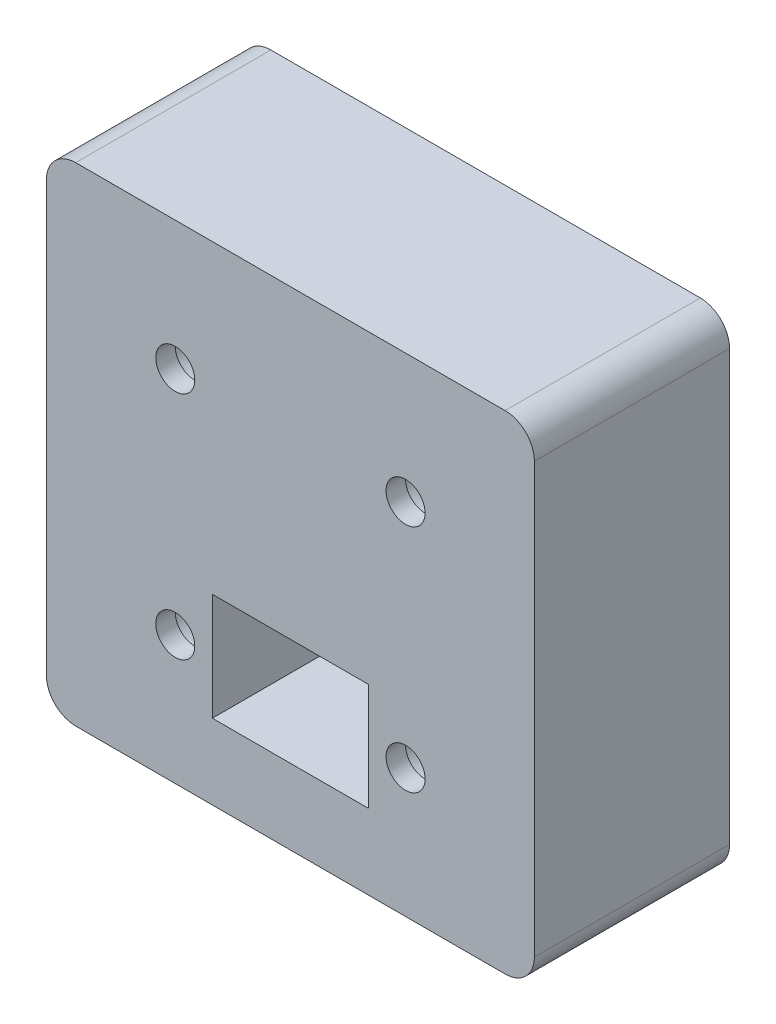
ISO-10303-21;
HEADER;
FILE_DESCRIPTION(('STEP AP214'),'2;1');
FILE_NAME('part.step','',(''),(''),'','','');
FILE_SCHEMA(('AUTOMOTIVE_DESIGN { 1 0 10303 214 1 1 1 1 }'));
ENDSEC;
DATA;
#1=APPLICATION_CONTEXT('core data for automotive mechanical design processes');
#2=APPLICATION_PROTOCOL_DEFINITION('international standard','automotive_design',2000,#1);
#3=PRODUCT_CONTEXT('',#1,'mechanical');
#4=PRODUCT('Part','Part','',(#3));
#5=PRODUCT_RELATED_PRODUCT_CATEGORY('part','',(#4));
#6=PRODUCT_DEFINITION_FORMATION('','',#4);
#7=PRODUCT_DEFINITION_CONTEXT('part definition',#1,'design');
#8=PRODUCT_DEFINITION('design','',#6,#7);
#9=PRODUCT_DEFINITION_SHAPE('','',#8);
#10=(LENGTH_UNIT() NAMED_UNIT(*) SI_UNIT(.MILLI.,.METRE.));
#11=(NAMED_UNIT(*) PLANE_ANGLE_UNIT() SI_UNIT($,.RADIAN.));
#12=(NAMED_UNIT(*) SI_UNIT($,.STERADIAN.) SOLID_ANGLE_UNIT());
#13=UNCERTAINTY_MEASURE_WITH_UNIT(LENGTH_MEASURE(1.E-05),#10,'distance_accuracy_value','');
#14=(GEOMETRIC_REPRESENTATION_CONTEXT(3) GLOBAL_UNCERTAINTY_ASSIGNED_CONTEXT((#13)) GLOBAL_UNIT_ASSIGNED_CONTEXT((#10,
#11,#12)) REPRESENTATION_CONTEXT('',''));
#15=CARTESIAN_POINT('',(0.,0.,0.));
#16=DIRECTION('',(0.,0.,1.));
#17=DIRECTION('',(1.,0.,0.));
#18=AXIS2_PLACEMENT_3D('',#15,#16,#17);
#19=CARTESIAN_POINT('',(0.,0.,0.));
#20=DIRECTION('',(0.,0.,-1.));
#21=DIRECTION('',(-1.,0.,0.));
#22=AXIS2_PLACEMENT_3D('',#19,#20,#21);
#23=PLANE('',#22);
#24=CARTESIAN_POINT('',(11.8,-11.8,0.));
#25=DIRECTION('',(0.,0.,-1.));
#26=DIRECTION('',(-1.,0.,0.));
#27=AXIS2_PLACEMENT_3D('',#24,#25,#26);
#28=CIRCLE('',#27,3.1);
#29=CARTESIAN_POINT('',(8.7,-11.8,0.));
#30=VERTEX_POINT('',#29);
#31=EDGE_CURVE('E276',#30,#30,#28,.F.);
#32=ORIENTED_EDGE('',*,*,#31,.F.);
#33=EDGE_LOOP('',(#32));
#34=FACE_BOUND('',#33,.T.);
#35=CARTESIAN_POINT('',(11.8,-11.8,0.));
#36=DIRECTION('',(0.,0.,1.));
#37=DIRECTION('',(1.,0.,0.));
#38=AXIS2_PLACEMENT_3D('',#35,#36,#37);
#39=CIRCLE('',#38,2.);
#40=CARTESIAN_POINT('',(13.8,-11.8,0.));
#41=VERTEX_POINT('',#40);
#42=EDGE_CURVE('E223',#41,#41,#39,.T.);
#43=ORIENTED_EDGE('',*,*,#42,.T.);
#44=EDGE_LOOP('',(#43));
#45=FACE_BOUND('',#44,.T.);
#46=ADVANCED_FACE('F43',(#34,#45),#23,.T.);
#47=CARTESIAN_POINT('',(-11.8,-11.8,0.));
#48=DIRECTION('',(0.,0.,-1.));
#49=DIRECTION('',(-1.,0.,0.));
#50=AXIS2_PLACEMENT_3D('',#47,#48,#49);
#51=CIRCLE('',#50,3.1);
#52=CARTESIAN_POINT('',(-14.9,-11.8,0.));
#53=VERTEX_POINT('',#52);
#54=EDGE_CURVE('E272',#53,#53,#51,.F.);
#55=ORIENTED_EDGE('',*,*,#54,.F.);
#56=EDGE_LOOP('',(#55));
#57=FACE_BOUND('',#56,.T.);
#58=CARTESIAN_POINT('',(-11.8,-11.8,0.));
#59=DIRECTION('',(0.,0.,1.));
#60=DIRECTION('',(-1.,0.,0.));
#61=AXIS2_PLACEMENT_3D('',#58,#59,#60);
#62=CIRCLE('',#61,2.);
#63=CARTESIAN_POINT('',(-13.8,-11.8,0.));
#64=VERTEX_POINT('',#63);
#65=EDGE_CURVE('E231',#64,#64,#62,.T.);
#66=ORIENTED_EDGE('',*,*,#65,.T.);
#67=EDGE_LOOP('',(#66));
#68=FACE_BOUND('',#67,.T.);
#69=ADVANCED_FACE('F364',(#57,#68),#23,.T.);
#70=CARTESIAN_POINT('',(-11.8,11.8,0.));
#71=DIRECTION('',(0.,0.,-1.));
#72=DIRECTION('',(-1.,0.,0.));
#73=AXIS2_PLACEMENT_3D('',#70,#71,#72);
#74=CIRCLE('',#73,3.1);
#75=CARTESIAN_POINT('',(-14.9,11.8,0.));
#76=VERTEX_POINT('',#75);
#77=EDGE_CURVE('E268',#76,#76,#74,.F.);
#78=ORIENTED_EDGE('',*,*,#77,.F.);
#79=EDGE_LOOP('',(#78));
#80=FACE_BOUND('',#79,.T.);
#81=CARTESIAN_POINT('',(-11.8,11.8,0.));
#82=DIRECTION('',(0.,0.,1.));
#83=DIRECTION('',(1.,0.,0.));
#84=AXIS2_PLACEMENT_3D('',#81,#82,#83);
#85=CIRCLE('',#84,2.);
#86=CARTESIAN_POINT('',(-9.8,11.8,0.));
#87=VERTEX_POINT('',#86);
#88=EDGE_CURVE('E239',#87,#87,#85,.T.);
#89=ORIENTED_EDGE('',*,*,#88,.T.);
#90=EDGE_LOOP('',(#89));
#91=FACE_BOUND('',#90,.T.);
#92=ADVANCED_FACE('F371',(#80,#91),#23,.T.);
#93=CARTESIAN_POINT('',(0.,0.,2.));
#94=DIRECTION('',(0.,0.,-1.));
#95=DIRECTION('',(-1.,0.,0.));
#96=AXIS2_PLACEMENT_3D('',#93,#94,#95);
#97=PLANE('',#96);
#98=CARTESIAN_POINT('',(11.8,11.8,2.));
#99=DIRECTION('',(0.,0.,1.));
#100=DIRECTION('',(-1.,0.,0.));
#101=AXIS2_PLACEMENT_3D('',#98,#99,#100);
#102=CIRCLE('',#101,2.);
#103=CARTESIAN_POINT('',(9.8,11.8,2.));
#104=VERTEX_POINT('',#103);
#105=EDGE_CURVE('E219',#104,#104,#102,.T.);
#106=ORIENTED_EDGE('',*,*,#105,.F.);
#107=EDGE_LOOP('',(#106));
#108=FACE_BOUND('',#107,.T.);
#109=CARTESIAN_POINT('',(11.8,-11.8,2.));
#110=DIRECTION('',(0.,0.,1.));
#111=DIRECTION('',(1.,0.,0.));
#112=AXIS2_PLACEMENT_3D('',#109,#110,#111);
#113=CIRCLE('',#112,2.);
#114=CARTESIAN_POINT('',(13.8,-11.8,2.));
#115=VERTEX_POINT('',#114);
#116=EDGE_CURVE('E227',#115,#115,#113,.T.);
#117=ORIENTED_EDGE('',*,*,#116,.F.);
#118=EDGE_LOOP('',(#117));
#119=FACE_BOUND('',#118,.T.);
#120=CARTESIAN_POINT('',(-11.8,-11.8,2.));
#121=DIRECTION('',(0.,0.,1.));
#122=DIRECTION('',(-1.,0.,0.));
#123=AXIS2_PLACEMENT_3D('',#120,#121,#122);
#124=CIRCLE('',#123,2.);
#125=CARTESIAN_POINT('',(-13.8,-11.8,2.));
#126=VERTEX_POINT('',#125);
#127=EDGE_CURVE('E235',#126,#126,#124,.T.);
#128=ORIENTED_EDGE('',*,*,#127,.F.);
#129=EDGE_LOOP('',(#128));
#130=FACE_BOUND('',#129,.T.);
#131=CARTESIAN_POINT('',(-11.8,11.8,2.));
#132=DIRECTION('',(0.,0.,1.));
#133=DIRECTION('',(1.,0.,0.));
#134=AXIS2_PLACEMENT_3D('',#131,#132,#133);
#135=CIRCLE('',#134,2.);
#136=CARTESIAN_POINT('',(-9.8,11.8,2.));
#137=VERTEX_POINT('',#136);
#138=EDGE_CURVE('E243',#137,#137,#135,.T.);
#139=ORIENTED_EDGE('',*,*,#138,.F.);
#140=EDGE_LOOP('',(#139));
#141=FACE_BOUND('',#140,.T.);
#142=DIRECTION('',(-1.,0.,0.));
#143=VECTOR('',#142,1.);
#144=CARTESIAN_POINT('',(-25.,25.,2.));
#145=LINE('',#144,#143);
#146=CARTESIAN_POINT('',(22.,25.,2.));
#147=VERTEX_POINT('',#146);
#148=CARTESIAN_POINT('',(-22.,25.,2.));
#149=VERTEX_POINT('',#148);
#150=EDGE_CURVE('E254',#147,#149,#145,.T.);
#151=ORIENTED_EDGE('',*,*,#150,.T.);
#152=CARTESIAN_POINT('',(-22.,22.,2.));
#153=DIRECTION('',(0.,0.,-1.));
#154=DIRECTION('',(-1.,0.,0.));
#155=AXIS2_PLACEMENT_3D('',#152,#153,#154);
#156=CIRCLE('',#155,3.);
#157=CARTESIAN_POINT('',(-25.,22.,2.));
#158=VERTEX_POINT('',#157);
#159=EDGE_CURVE('E314',#149,#158,#156,.F.);
#160=ORIENTED_EDGE('',*,*,#159,.T.);
#161=DIRECTION('',(0.,-1.,0.));
#162=VECTOR('',#161,1.);
#163=CARTESIAN_POINT('',(-25.,-25.,2.));
#164=LINE('',#163,#162);
#165=CARTESIAN_POINT('',(-25.,-22.,2.));
#166=VERTEX_POINT('',#165);
#167=EDGE_CURVE('E258',#158,#166,#164,.T.);
#168=ORIENTED_EDGE('',*,*,#167,.T.);
#169=CARTESIAN_POINT('',(-22.,-22.,2.));
#170=DIRECTION('',(0.,0.,-1.));
#171=DIRECTION('',(-1.,0.,0.));
#172=AXIS2_PLACEMENT_3D('',#169,#170,#171);
#173=CIRCLE('',#172,3.);
#174=CARTESIAN_POINT('',(-22.,-25.,2.));
#175=VERTEX_POINT('',#174);
#176=EDGE_CURVE('E64',#166,#175,#173,.F.);
#177=ORIENTED_EDGE('',*,*,#176,.T.);
#178=DIRECTION('',(1.,0.,0.));
#179=VECTOR('',#178,1.);
#180=CARTESIAN_POINT('',(-25.,-25.,2.));
#181=LINE('',#180,#179);
#182=CARTESIAN_POINT('',(22.,-25.,2.));
#183=VERTEX_POINT('',#182);
#184=EDGE_CURVE('E261',#175,#183,#181,.T.);
#185=ORIENTED_EDGE('',*,*,#184,.T.);
#186=CARTESIAN_POINT('',(22.,-22.,2.));
#187=DIRECTION('',(0.,0.,-1.));
#188=DIRECTION('',(-1.,0.,0.));
#189=AXIS2_PLACEMENT_3D('',#186,#187,#188);
#190=CIRCLE('',#189,3.);
#191=CARTESIAN_POINT('',(25.,-22.,2.));
#192=VERTEX_POINT('',#191);
#193=EDGE_CURVE('E308',#183,#192,#190,.F.);
#194=ORIENTED_EDGE('',*,*,#193,.T.);
#195=DIRECTION('',(0.,1.,0.));
#196=VECTOR('',#195,1.);
#197=CARTESIAN_POINT('',(25.,-25.,2.));
#198=LINE('',#197,#196);
#199=CARTESIAN_POINT('',(25.,22.,2.));
#200=VERTEX_POINT('',#199);
#201=EDGE_CURVE('E247',#192,#200,#198,.T.);
#202=ORIENTED_EDGE('',*,*,#201,.T.);
#203=CARTESIAN_POINT('',(22.,22.,2.));
#204=DIRECTION('',(0.,0.,-1.));
#205=DIRECTION('',(-1.,0.,0.));
#206=AXIS2_PLACEMENT_3D('',#203,#204,#205);
#207=CIRCLE('',#206,3.);
#208=EDGE_CURVE('E311',#200,#147,#207,.F.);
#209=ORIENTED_EDGE('',*,*,#208,.T.);
#210=EDGE_LOOP('',(#151,#160,#168,#177,#185,#194,#202,#209));
#211=FACE_BOUND('',#210,.T.);
#212=DIRECTION('',(0.,1.,0.));
#213=VECTOR('',#212,1.);
#214=CARTESIAN_POINT('',(8.,-17.3,2.));
#215=LINE('',#214,#213);
#216=CARTESIAN_POINT('',(8.,-17.3,2.));
#217=VERTEX_POINT('',#216);
#218=CARTESIAN_POINT('',(8.,-6.3,2.));
#219=VERTEX_POINT('',#218);
#220=EDGE_CURVE('E199',#217,#219,#215,.T.);
#221=ORIENTED_EDGE('',*,*,#220,.F.);
#222=DIRECTION('',(1.,0.,0.));
#223=VECTOR('',#222,1.);
#224=CARTESIAN_POINT('',(-8.,-17.3,2.));
#225=LINE('',#224,#223);
#226=CARTESIAN_POINT('',(-8.,-17.3,2.));
#227=VERTEX_POINT('',#226);
#228=EDGE_CURVE('E140',#227,#217,#225,.T.);
#229=ORIENTED_EDGE('',*,*,#228,.F.);
#230=DIRECTION('',(0.,-1.,0.));
#231=VECTOR('',#230,1.);
#232=CARTESIAN_POINT('',(-8.,-17.3,2.));
#233=LINE('',#232,#231);
#234=CARTESIAN_POINT('',(-8.,-6.3,2.));
#235=VERTEX_POINT('',#234);
#236=EDGE_CURVE('E205',#235,#227,#233,.T.);
#237=ORIENTED_EDGE('',*,*,#236,.F.);
#238=DIRECTION('',(-1.,0.,0.));
#239=VECTOR('',#238,1.);
#240=CARTESIAN_POINT('',(-8.,-6.3,2.));
#241=LINE('',#240,#239);
#242=EDGE_CURVE('E202',#219,#235,#241,.T.);
#243=ORIENTED_EDGE('',*,*,#242,.F.);
#244=EDGE_LOOP('',(#221,#229,#237,#243));
#245=FACE_BOUND('',#244,.T.);
#246=ADVANCED_FACE('F341',(#108,#119,#130,#141,#211,#245),#97,.F.);
#247=CARTESIAN_POINT('',(11.8,11.8,0.));
#248=DIRECTION('',(0.,0.,-1.));
#249=DIRECTION('',(-1.,0.,0.));
#250=AXIS2_PLACEMENT_3D('',#247,#248,#249);
#251=CIRCLE('',#250,3.1);
#252=CARTESIAN_POINT('',(8.7,11.8,0.));
#253=VERTEX_POINT('',#252);
#254=EDGE_CURVE('E264',#253,#253,#251,.F.);
#255=ORIENTED_EDGE('',*,*,#254,.F.);
#256=EDGE_LOOP('',(#255));
#257=FACE_BOUND('',#256,.T.);
#258=CARTESIAN_POINT('',(11.8,11.8,0.));
#259=DIRECTION('',(0.,0.,1.));
#260=DIRECTION('',(-1.,0.,0.));
#261=AXIS2_PLACEMENT_3D('',#258,#259,#260);
#262=CIRCLE('',#261,2.);
#263=CARTESIAN_POINT('',(9.8,11.8,0.));
#264=VERTEX_POINT('',#263);
#265=EDGE_CURVE('E218',#264,#264,#262,.T.);
#266=ORIENTED_EDGE('',*,*,#265,.T.);
#267=EDGE_LOOP('',(#266));
#268=FACE_BOUND('',#267,.T.);
#269=ADVANCED_FACE('F367',(#257,#268),#23,.T.);
#270=CARTESIAN_POINT('',(25.,-25.,2.));
#271=DIRECTION('',(-1.,0.,0.));
#272=DIRECTION('',(0.,0.,1.));
#273=AXIS2_PLACEMENT_3D('',#270,#271,#272);
#274=PLANE('',#273);
#275=DIRECTION('',(0.,-1.,0.));
#276=VECTOR('',#275,1.);
#277=CARTESIAN_POINT('',(25.,-25.,-18.));
#278=LINE('',#277,#276);
#279=CARTESIAN_POINT('',(25.,22.,-18.));
#280=VERTEX_POINT('',#279);
#281=CARTESIAN_POINT('',(25.,-22.,-18.));
#282=VERTEX_POINT('',#281);
#283=EDGE_CURVE('E183',#280,#282,#278,.T.);
#284=ORIENTED_EDGE('',*,*,#283,.F.);
#285=DIRECTION('',(0.,0.,-1.));
#286=VECTOR('',#285,1.);
#287=CARTESIAN_POINT('',(25.,22.,2.));
#288=LINE('',#287,#286);
#289=EDGE_CURVE('E321',#280,#200,#288,.F.);
#290=ORIENTED_EDGE('',*,*,#289,.T.);
#291=ORIENTED_EDGE('',*,*,#201,.F.);
#292=DIRECTION('',(0.,0.,-1.));
#293=VECTOR('',#292,1.);
#294=CARTESIAN_POINT('',(25.,-22.,2.));
#295=LINE('',#294,#293);
#296=EDGE_CURVE('E317',#192,#282,#295,.T.);
#297=ORIENTED_EDGE('',*,*,#296,.T.);
#298=EDGE_LOOP('',(#284,#290,#291,#297));
#299=FACE_BOUND('',#298,.T.);
#300=ADVANCED_FACE('F338',(#299),#274,.F.);
#301=CARTESIAN_POINT('',(-25.,25.,2.));
#302=DIRECTION('',(0.,-1.,0.));
#303=DIRECTION('',(0.,0.,-1.));
#304=AXIS2_PLACEMENT_3D('',#301,#302,#303);
#305=PLANE('',#304);
#306=DIRECTION('',(1.,0.,0.));
#307=VECTOR('',#306,1.);
#308=CARTESIAN_POINT('',(-25.,25.,-18.));
#309=LINE('',#308,#307);
#310=CARTESIAN_POINT('',(-22.,25.,-18.));
#311=VERTEX_POINT('',#310);
#312=CARTESIAN_POINT('',(22.,25.,-18.));
#313=VERTEX_POINT('',#312);
#314=EDGE_CURVE('E195',#311,#313,#309,.T.);
#315=ORIENTED_EDGE('',*,*,#314,.F.);
#316=DIRECTION('',(0.,0.,-1.));
#317=VECTOR('',#316,1.);
#318=CARTESIAN_POINT('',(-22.,25.,2.));
#319=LINE('',#318,#317);
#320=EDGE_CURVE('E303',#311,#149,#319,.F.);
#321=ORIENTED_EDGE('',*,*,#320,.T.);
#322=ORIENTED_EDGE('',*,*,#150,.F.);
#323=DIRECTION('',(0.,0.,-1.));
#324=VECTOR('',#323,1.);
#325=CARTESIAN_POINT('',(22.,25.,2.));
#326=LINE('',#325,#324);
#327=EDGE_CURVE('E299',#147,#313,#326,.T.);
#328=ORIENTED_EDGE('',*,*,#327,.T.);
#329=EDGE_LOOP('',(#315,#321,#322,#328));
#330=FACE_BOUND('',#329,.T.);
#331=ADVANCED_FACE('F349',(#330),#305,.F.);
#332=CARTESIAN_POINT('',(-25.,-25.,2.));
#333=DIRECTION('',(1.,0.,0.));
#334=DIRECTION('',(0.,0.,-1.));
#335=AXIS2_PLACEMENT_3D('',#332,#333,#334);
#336=PLANE('',#335);
#337=ORIENTED_EDGE('',*,*,#167,.F.);
#338=DIRECTION('',(0.,0.,-1.));
#339=VECTOR('',#338,1.);
#340=CARTESIAN_POINT('',(-25.,22.,2.));
#341=LINE('',#340,#339);
#342=CARTESIAN_POINT('',(-25.,22.,-18.));
#343=VERTEX_POINT('',#342);
#344=EDGE_CURVE('E283',#158,#343,#341,.T.);
#345=ORIENTED_EDGE('',*,*,#344,.T.);
#346=DIRECTION('',(0.,1.,0.));
#347=VECTOR('',#346,1.);
#348=CARTESIAN_POINT('',(-25.,-25.,-18.));
#349=LINE('',#348,#347);
#350=CARTESIAN_POINT('',(-25.,-22.,-18.));
#351=VERTEX_POINT('',#350);
#352=EDGE_CURVE('E191',#351,#343,#349,.T.);
#353=ORIENTED_EDGE('',*,*,#352,.F.);
#354=DIRECTION('',(0.,0.,-1.));
#355=VECTOR('',#354,1.);
#356=CARTESIAN_POINT('',(-25.,-22.,2.));
#357=LINE('',#356,#355);
#358=EDGE_CURVE('E280',#351,#166,#357,.F.);
#359=ORIENTED_EDGE('',*,*,#358,.T.);
#360=EDGE_LOOP('',(#337,#345,#353,#359));
#361=FACE_BOUND('',#360,.T.);
#362=ADVANCED_FACE('F357',(#361),#336,.F.);
#363=CARTESIAN_POINT('',(-25.,-25.,2.));
#364=DIRECTION('',(0.,1.,0.));
#365=DIRECTION('',(0.,0.,1.));
#366=AXIS2_PLACEMENT_3D('',#363,#364,#365);
#367=PLANE('',#366);
#368=DIRECTION('',(-1.,0.,0.));
#369=VECTOR('',#368,1.);
#370=CARTESIAN_POINT('',(-25.,-25.,-18.));
#371=LINE('',#370,#369);
#372=CARTESIAN_POINT('',(22.,-25.,-18.));
#373=VERTEX_POINT('',#372);
#374=CARTESIAN_POINT('',(-22.,-25.,-18.));
#375=VERTEX_POINT('',#374);
#376=EDGE_CURVE('E187',#373,#375,#371,.T.);
#377=ORIENTED_EDGE('',*,*,#376,.F.);
#378=DIRECTION('',(0.,0.,-1.));
#379=VECTOR('',#378,1.);
#380=CARTESIAN_POINT('',(22.,-25.,2.));
#381=LINE('',#380,#379);
#382=EDGE_CURVE('E11',#373,#183,#381,.F.);
#383=ORIENTED_EDGE('',*,*,#382,.T.);
#384=ORIENTED_EDGE('',*,*,#184,.F.);
#385=DIRECTION('',(0.,0.,-1.));
#386=VECTOR('',#385,1.);
#387=CARTESIAN_POINT('',(-22.,-25.,2.));
#388=LINE('',#387,#386);
#389=EDGE_CURVE('E52',#175,#375,#388,.T.);
#390=ORIENTED_EDGE('',*,*,#389,.T.);
#391=EDGE_LOOP('',(#377,#383,#384,#390));
#392=FACE_BOUND('',#391,.T.);
#393=ADVANCED_FACE('F326',(#392),#367,.F.);
#394=CARTESIAN_POINT('',(-11.8,11.8,2.));
#395=DIRECTION('',(0.,0.,-1.));
#396=DIRECTION('',(-1.,0.,0.));
#397=AXIS2_PLACEMENT_3D('',#394,#395,#396);
#398=CYLINDRICAL_SURFACE('',#397,2.);
#399=ORIENTED_EDGE('',*,*,#138,.T.);
#400=EDGE_LOOP('',(#399));
#401=FACE_BOUND('',#400,.T.);
#402=ORIENTED_EDGE('',*,*,#88,.F.);
#403=EDGE_LOOP('',(#402));
#404=FACE_BOUND('',#403,.T.);
#405=ADVANCED_FACE('F395',(#401,#404),#398,.F.);
#406=CARTESIAN_POINT('',(-11.8,-11.8,2.));
#407=DIRECTION('',(0.,0.,-1.));
#408=DIRECTION('',(-1.,0.,0.));
#409=AXIS2_PLACEMENT_3D('',#406,#407,#408);
#410=CYLINDRICAL_SURFACE('',#409,2.);
#411=ORIENTED_EDGE('',*,*,#127,.T.);
#412=EDGE_LOOP('',(#411));
#413=FACE_BOUND('',#412,.T.);
#414=ORIENTED_EDGE('',*,*,#65,.F.);
#415=EDGE_LOOP('',(#414));
#416=FACE_BOUND('',#415,.T.);
#417=ADVANCED_FACE('F397',(#413,#416),#410,.F.);
#418=CARTESIAN_POINT('',(11.8,-11.8,2.));
#419=DIRECTION('',(0.,0.,-1.));
#420=DIRECTION('',(-1.,0.,0.));
#421=AXIS2_PLACEMENT_3D('',#418,#419,#420);
#422=CYLINDRICAL_SURFACE('',#421,2.);
#423=ORIENTED_EDGE('',*,*,#116,.T.);
#424=EDGE_LOOP('',(#423));
#425=FACE_BOUND('',#424,.T.);
#426=ORIENTED_EDGE('',*,*,#42,.F.);
#427=EDGE_LOOP('',(#426));
#428=FACE_BOUND('',#427,.T.);
#429=ADVANCED_FACE('F404',(#425,#428),#422,.F.);
#430=CARTESIAN_POINT('',(11.8,11.8,2.));
#431=DIRECTION('',(0.,0.,-1.));
#432=DIRECTION('',(-1.,0.,0.));
#433=AXIS2_PLACEMENT_3D('',#430,#431,#432);
#434=CYLINDRICAL_SURFACE('',#433,2.);
#435=ORIENTED_EDGE('',*,*,#105,.T.);
#436=EDGE_LOOP('',(#435));
#437=FACE_BOUND('',#436,.T.);
#438=ORIENTED_EDGE('',*,*,#265,.F.);
#439=EDGE_LOOP('',(#438));
#440=FACE_BOUND('',#439,.T.);
#441=ADVANCED_FACE('F410',(#437,#440),#434,.F.);
#442=CARTESIAN_POINT('',(8.,-17.3,2.));
#443=DIRECTION('',(-1.,0.,0.));
#444=DIRECTION('',(0.,0.,1.));
#445=AXIS2_PLACEMENT_3D('',#442,#443,#444);
#446=PLANE('',#445);
#447=DIRECTION('',(0.,0.,-1.));
#448=VECTOR('',#447,1.);
#449=CARTESIAN_POINT('',(8.,-6.3,2.));
#450=LINE('',#449,#448);
#451=CARTESIAN_POINT('',(8.,-6.3,-18.));
#452=VERTEX_POINT('',#451);
#453=EDGE_CURVE('E150',#219,#452,#450,.T.);
#454=ORIENTED_EDGE('',*,*,#453,.T.);
#455=DIRECTION('',(0.,-1.,0.));
#456=VECTOR('',#455,1.);
#457=CARTESIAN_POINT('',(8.,-17.3,-18.));
#458=LINE('',#457,#456);
#459=CARTESIAN_POINT('',(8.,-17.3,-18.));
#460=VERTEX_POINT('',#459);
#461=EDGE_CURVE('E147',#452,#460,#458,.T.);
#462=ORIENTED_EDGE('',*,*,#461,.T.);
#463=DIRECTION('',(0.,0.,-1.));
#464=VECTOR('',#463,1.);
#465=CARTESIAN_POINT('',(8.,-17.3,2.));
#466=LINE('',#465,#464);
#467=EDGE_CURVE('E133',#217,#460,#466,.T.);
#468=ORIENTED_EDGE('',*,*,#467,.F.);
#469=ORIENTED_EDGE('',*,*,#220,.T.);
#470=EDGE_LOOP('',(#454,#462,#468,#469));
#471=FACE_BOUND('',#470,.T.);
#472=ADVANCED_FACE('F148',(#471),#446,.T.);
#473=CARTESIAN_POINT('',(-8.,-6.3,2.));
#474=DIRECTION('',(0.,-1.,0.));
#475=DIRECTION('',(0.,0.,-1.));
#476=AXIS2_PLACEMENT_3D('',#473,#474,#475);
#477=PLANE('',#476);
#478=DIRECTION('',(0.,0.,-1.));
#479=VECTOR('',#478,1.);
#480=CARTESIAN_POINT('',(-8.,-6.3,2.));
#481=LINE('',#480,#479);
#482=CARTESIAN_POINT('',(-8.,-6.3,-18.));
#483=VERTEX_POINT('',#482);
#484=EDGE_CURVE('E213',#235,#483,#481,.T.);
#485=ORIENTED_EDGE('',*,*,#484,.T.);
#486=DIRECTION('',(1.,0.,0.));
#487=VECTOR('',#486,1.);
#488=CARTESIAN_POINT('',(-8.,-6.3,-18.));
#489=LINE('',#488,#487);
#490=EDGE_CURVE('E162',#483,#452,#489,.T.);
#491=ORIENTED_EDGE('',*,*,#490,.T.);
#492=ORIENTED_EDGE('',*,*,#453,.F.);
#493=ORIENTED_EDGE('',*,*,#242,.T.);
#494=EDGE_LOOP('',(#485,#491,#492,#493));
#495=FACE_BOUND('',#494,.T.);
#496=ADVANCED_FACE('F417',(#495),#477,.T.);
#497=CARTESIAN_POINT('',(-8.,-17.3,2.));
#498=DIRECTION('',(1.,0.,0.));
#499=DIRECTION('',(0.,0.,-1.));
#500=AXIS2_PLACEMENT_3D('',#497,#498,#499);
#501=PLANE('',#500);
#502=DIRECTION('',(0.,0.,-1.));
#503=VECTOR('',#502,1.);
#504=CARTESIAN_POINT('',(-8.,-17.3,2.));
#505=LINE('',#504,#503);
#506=CARTESIAN_POINT('',(-8.,-17.3,-18.));
#507=VERTEX_POINT('',#506);
#508=EDGE_CURVE('E144',#227,#507,#505,.T.);
#509=ORIENTED_EDGE('',*,*,#508,.T.);
#510=DIRECTION('',(0.,1.,0.));
#511=VECTOR('',#510,1.);
#512=CARTESIAN_POINT('',(-8.,-17.3,-18.));
#513=LINE('',#512,#511);
#514=EDGE_CURVE('E158',#507,#483,#513,.T.);
#515=ORIENTED_EDGE('',*,*,#514,.T.);
#516=ORIENTED_EDGE('',*,*,#484,.F.);
#517=ORIENTED_EDGE('',*,*,#236,.T.);
#518=EDGE_LOOP('',(#509,#515,#516,#517));
#519=FACE_BOUND('',#518,.T.);
#520=ADVANCED_FACE('F420',(#519),#501,.T.);
#521=CARTESIAN_POINT('',(-8.,-17.3,2.));
#522=DIRECTION('',(0.,1.,0.));
#523=DIRECTION('',(0.,0.,1.));
#524=AXIS2_PLACEMENT_3D('',#521,#522,#523);
#525=PLANE('',#524);
#526=ORIENTED_EDGE('',*,*,#467,.T.);
#527=DIRECTION('',(-1.,0.,0.));
#528=VECTOR('',#527,1.);
#529=CARTESIAN_POINT('',(-8.,-17.3,-18.));
#530=LINE('',#529,#528);
#531=EDGE_CURVE('E137',#460,#507,#530,.T.);
#532=ORIENTED_EDGE('',*,*,#531,.T.);
#533=ORIENTED_EDGE('',*,*,#508,.F.);
#534=ORIENTED_EDGE('',*,*,#228,.T.);
#535=EDGE_LOOP('',(#526,#532,#533,#534));
#536=FACE_BOUND('',#535,.T.);
#537=ADVANCED_FACE('F135',(#536),#525,.T.);
#538=CARTESIAN_POINT('',(0.,0.,-18.));
#539=DIRECTION('',(0.,0.,-1.));
#540=DIRECTION('',(-1.,0.,0.));
#541=AXIS2_PLACEMENT_3D('',#538,#539,#540);
#542=PLANE('',#541);
#543=CARTESIAN_POINT('',(-11.8,11.8,-18.));
#544=DIRECTION('',(0.,0.,-1.));
#545=DIRECTION('',(-1.,0.,0.));
#546=AXIS2_PLACEMENT_3D('',#543,#544,#545);
#547=CIRCLE('',#546,3.1);
#548=CARTESIAN_POINT('',(-14.9,11.8,-18.));
#549=VERTEX_POINT('',#548);
#550=EDGE_CURVE('E171',#549,#549,#547,.T.);
#551=ORIENTED_EDGE('',*,*,#550,.F.);
#552=EDGE_LOOP('',(#551));
#553=FACE_BOUND('',#552,.T.);
#554=CARTESIAN_POINT('',(11.8,-11.8,-18.));
#555=DIRECTION('',(0.,0.,-1.));
#556=DIRECTION('',(-1.,0.,0.));
#557=AXIS2_PLACEMENT_3D('',#554,#555,#556);
#558=CIRCLE('',#557,3.1);
#559=CARTESIAN_POINT('',(8.7,-11.8,-18.));
#560=VERTEX_POINT('',#559);
#561=EDGE_CURVE('E179',#560,#560,#558,.T.);
#562=ORIENTED_EDGE('',*,*,#561,.F.);
#563=EDGE_LOOP('',(#562));
#564=FACE_BOUND('',#563,.T.);
#565=ORIENTED_EDGE('',*,*,#352,.T.);
#566=CARTESIAN_POINT('',(-22.,22.,-18.));
#567=DIRECTION('',(0.,0.,-1.));
#568=DIRECTION('',(-1.,0.,0.));
#569=AXIS2_PLACEMENT_3D('',#566,#567,#568);
#570=CIRCLE('',#569,3.);
#571=EDGE_CURVE('E296',#343,#311,#570,.T.);
#572=ORIENTED_EDGE('',*,*,#571,.T.);
#573=ORIENTED_EDGE('',*,*,#314,.T.);
#574=CARTESIAN_POINT('',(22.,22.,-18.));
#575=DIRECTION('',(0.,0.,-1.));
#576=DIRECTION('',(-1.,0.,0.));
#577=AXIS2_PLACEMENT_3D('',#574,#575,#576);
#578=CIRCLE('',#577,3.);
#579=EDGE_CURVE('E293',#313,#280,#578,.T.);
#580=ORIENTED_EDGE('',*,*,#579,.T.);
#581=ORIENTED_EDGE('',*,*,#283,.T.);
#582=CARTESIAN_POINT('',(22.,-22.,-18.));
#583=DIRECTION('',(0.,0.,-1.));
#584=DIRECTION('',(-1.,0.,0.));
#585=AXIS2_PLACEMENT_3D('',#582,#583,#584);
#586=CIRCLE('',#585,3.);
#587=EDGE_CURVE('E290',#282,#373,#586,.T.);
#588=ORIENTED_EDGE('',*,*,#587,.T.);
#589=ORIENTED_EDGE('',*,*,#376,.T.);
#590=CARTESIAN_POINT('',(-22.,-22.,-18.));
#591=DIRECTION('',(0.,0.,-1.));
#592=DIRECTION('',(-1.,0.,0.));
#593=AXIS2_PLACEMENT_3D('',#590,#591,#592);
#594=CIRCLE('',#593,3.);
#595=EDGE_CURVE('E287',#375,#351,#594,.T.);
#596=ORIENTED_EDGE('',*,*,#595,.T.);
#597=EDGE_LOOP('',(#565,#572,#573,#580,#581,#588,#589,#596));
#598=FACE_BOUND('',#597,.T.);
#599=CARTESIAN_POINT('',(-11.8,-11.8,-18.));
#600=DIRECTION('',(0.,0.,-1.));
#601=DIRECTION('',(1.,0.,0.));
#602=AXIS2_PLACEMENT_3D('',#599,#600,#601);
#603=CIRCLE('',#602,3.1);
#604=CARTESIAN_POINT('',(-8.7,-11.8,-18.));
#605=VERTEX_POINT('',#604);
#606=EDGE_CURVE('E175',#605,#605,#603,.T.);
#607=ORIENTED_EDGE('',*,*,#606,.F.);
#608=EDGE_LOOP('',(#607));
#609=FACE_BOUND('',#608,.T.);
#610=CARTESIAN_POINT('',(11.8,11.8,-18.));
#611=DIRECTION('',(0.,0.,-1.));
#612=DIRECTION('',(1.,0.,0.));
#613=AXIS2_PLACEMENT_3D('',#610,#611,#612);
#614=CIRCLE('',#613,3.1);
#615=CARTESIAN_POINT('',(14.9,11.8,-18.));
#616=VERTEX_POINT('',#615);
#617=EDGE_CURVE('E167',#616,#616,#614,.T.);
#618=ORIENTED_EDGE('',*,*,#617,.F.);
#619=EDGE_LOOP('',(#618));
#620=FACE_BOUND('',#619,.T.);
#621=ORIENTED_EDGE('',*,*,#531,.F.);
#622=ORIENTED_EDGE('',*,*,#461,.F.);
#623=ORIENTED_EDGE('',*,*,#490,.F.);
#624=ORIENTED_EDGE('',*,*,#514,.F.);
#625=EDGE_LOOP('',(#621,#622,#623,#624));
#626=FACE_BOUND('',#625,.T.);
#627=ADVANCED_FACE('F156',(#553,#564,#598,#609,#620,#626),#542,.T.);
#628=CARTESIAN_POINT('',(11.8,-11.8,-18.));
#629=DIRECTION('',(0.,0.,1.));
#630=DIRECTION('',(1.,0.,0.));
#631=AXIS2_PLACEMENT_3D('',#628,#629,#630);
#632=CYLINDRICAL_SURFACE('',#631,3.1);
#633=ORIENTED_EDGE('',*,*,#561,.T.);
#634=EDGE_LOOP('',(#633));
#635=FACE_BOUND('',#634,.T.);
#636=ORIENTED_EDGE('',*,*,#31,.T.);
#637=EDGE_LOOP('',(#636));
#638=FACE_BOUND('',#637,.T.);
#639=ADVANCED_FACE('F429',(#635,#638),#632,.F.);
#640=CARTESIAN_POINT('',(-11.8,-11.8,-18.));
#641=DIRECTION('',(0.,0.,1.));
#642=DIRECTION('',(1.,0.,0.));
#643=AXIS2_PLACEMENT_3D('',#640,#641,#642);
#644=CYLINDRICAL_SURFACE('',#643,3.1);
#645=ORIENTED_EDGE('',*,*,#606,.T.);
#646=EDGE_LOOP('',(#645));
#647=FACE_BOUND('',#646,.T.);
#648=ORIENTED_EDGE('',*,*,#54,.T.);
#649=EDGE_LOOP('',(#648));
#650=FACE_BOUND('',#649,.T.);
#651=ADVANCED_FACE('F433',(#647,#650),#644,.F.);
#652=CARTESIAN_POINT('',(-11.8,11.8,-18.));
#653=DIRECTION('',(0.,0.,1.));
#654=DIRECTION('',(1.,0.,0.));
#655=AXIS2_PLACEMENT_3D('',#652,#653,#654);
#656=CYLINDRICAL_SURFACE('',#655,3.1);
#657=ORIENTED_EDGE('',*,*,#550,.T.);
#658=EDGE_LOOP('',(#657));
#659=FACE_BOUND('',#658,.T.);
#660=ORIENTED_EDGE('',*,*,#77,.T.);
#661=EDGE_LOOP('',(#660));
#662=FACE_BOUND('',#661,.T.);
#663=ADVANCED_FACE('F437',(#659,#662),#656,.F.);
#664=CARTESIAN_POINT('',(11.8,11.8,-18.));
#665=DIRECTION('',(0.,0.,1.));
#666=DIRECTION('',(1.,0.,0.));
#667=AXIS2_PLACEMENT_3D('',#664,#665,#666);
#668=CYLINDRICAL_SURFACE('',#667,3.1);
#669=ORIENTED_EDGE('',*,*,#617,.T.);
#670=EDGE_LOOP('',(#669));
#671=FACE_BOUND('',#670,.T.);
#672=ORIENTED_EDGE('',*,*,#254,.T.);
#673=EDGE_LOOP('',(#672));
#674=FACE_BOUND('',#673,.T.);
#675=ADVANCED_FACE('F441',(#671,#674),#668,.F.);
#676=CARTESIAN_POINT('',(-22.,22.,2.));
#677=DIRECTION('',(0.,0.,-1.));
#678=DIRECTION('',(-1.,0.,0.));
#679=AXIS2_PLACEMENT_3D('',#676,#677,#678);
#680=CYLINDRICAL_SURFACE('',#679,3.);
#681=ORIENTED_EDGE('',*,*,#159,.F.);
#682=ORIENTED_EDGE('',*,*,#320,.F.);
#683=ORIENTED_EDGE('',*,*,#571,.F.);
#684=ORIENTED_EDGE('',*,*,#344,.F.);
#685=EDGE_LOOP('',(#681,#682,#683,#684));
#686=FACE_BOUND('',#685,.T.);
#687=ADVANCED_FACE('F354',(#686),#680,.T.);
#688=CARTESIAN_POINT('',(22.,22.,2.));
#689=DIRECTION('',(0.,0.,-1.));
#690=DIRECTION('',(-1.,0.,0.));
#691=AXIS2_PLACEMENT_3D('',#688,#689,#690);
#692=CYLINDRICAL_SURFACE('',#691,3.);
#693=ORIENTED_EDGE('',*,*,#208,.F.);
#694=ORIENTED_EDGE('',*,*,#289,.F.);
#695=ORIENTED_EDGE('',*,*,#579,.F.);
#696=ORIENTED_EDGE('',*,*,#327,.F.);
#697=EDGE_LOOP('',(#693,#694,#695,#696));
#698=FACE_BOUND('',#697,.T.);
#699=ADVANCED_FACE('F346',(#698),#692,.T.);
#700=CARTESIAN_POINT('',(22.,-22.,2.));
#701=DIRECTION('',(0.,0.,-1.));
#702=DIRECTION('',(-1.,0.,0.));
#703=AXIS2_PLACEMENT_3D('',#700,#701,#702);
#704=CYLINDRICAL_SURFACE('',#703,3.);
#705=ORIENTED_EDGE('',*,*,#193,.F.);
#706=ORIENTED_EDGE('',*,*,#382,.F.);
#707=ORIENTED_EDGE('',*,*,#587,.F.);
#708=ORIENTED_EDGE('',*,*,#296,.F.);
#709=EDGE_LOOP('',(#705,#706,#707,#708));
#710=FACE_BOUND('',#709,.T.);
#711=ADVANCED_FACE('F335',(#710),#704,.T.);
#712=CARTESIAN_POINT('',(-22.,-22.,2.));
#713=DIRECTION('',(0.,0.,-1.));
#714=DIRECTION('',(-1.,0.,0.));
#715=AXIS2_PLACEMENT_3D('',#712,#713,#714);
#716=CYLINDRICAL_SURFACE('',#715,3.);
#717=ORIENTED_EDGE('',*,*,#176,.F.);
#718=ORIENTED_EDGE('',*,*,#358,.F.);
#719=ORIENTED_EDGE('',*,*,#595,.F.);
#720=ORIENTED_EDGE('',*,*,#389,.F.);
#721=EDGE_LOOP('',(#717,#718,#719,#720));
#722=FACE_BOUND('',#721,.T.);
#723=ADVANCED_FACE('F45',(#722),#716,.T.);
#724=CLOSED_SHELL('',(#46,#69,#92,#246,#269,#300,#331,#362,#393,#405,#417,#429,#441,#472,#496,
#520,#537,#627,#639,#651,#663,#675,#687,#699,#711,#723));
#725=MANIFOLD_SOLID_BREP('B2',#724);
#726=ADVANCED_BREP_SHAPE_REPRESENTATION('',(#18,#725),#14);
#727=SHAPE_DEFINITION_REPRESENTATION(#9,#726);
ENDSEC;
END-ISO-10303-21;
